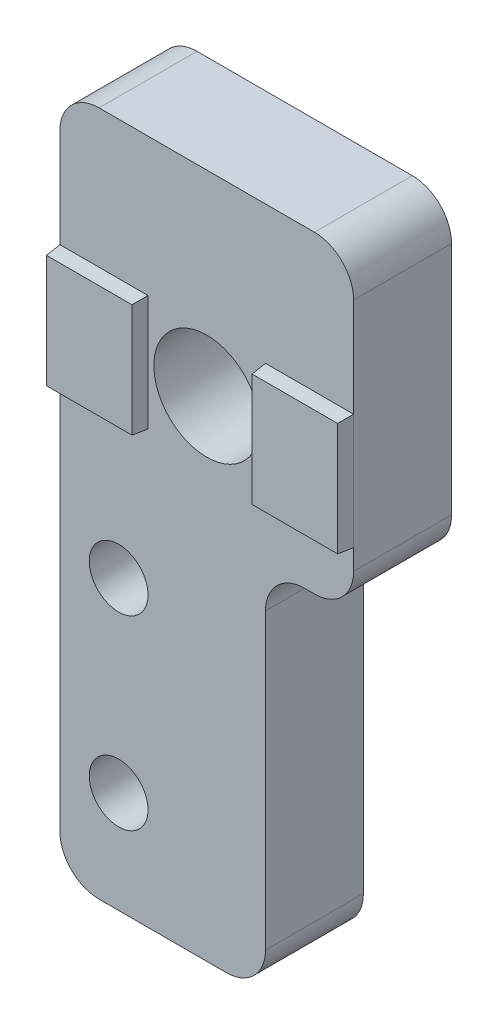
ISO-10303-21;
HEADER;
FILE_DESCRIPTION(('STEP AP214'),'2;1');
FILE_NAME('part.step','',(''),(''),'','','');
FILE_SCHEMA(('AUTOMOTIVE_DESIGN { 1 0 10303 214 1 1 1 1 }'));
ENDSEC;
DATA;
#1=APPLICATION_CONTEXT('core data for automotive mechanical design processes');
#2=APPLICATION_PROTOCOL_DEFINITION('international standard','automotive_design',2000,#1);
#3=PRODUCT_CONTEXT('',#1,'mechanical');
#4=PRODUCT('Part','Part','',(#3));
#5=PRODUCT_RELATED_PRODUCT_CATEGORY('part','',(#4));
#6=PRODUCT_DEFINITION_FORMATION('','',#4);
#7=PRODUCT_DEFINITION_CONTEXT('part definition',#1,'design');
#8=PRODUCT_DEFINITION('design','',#6,#7);
#9=PRODUCT_DEFINITION_SHAPE('','',#8);
#10=(LENGTH_UNIT() NAMED_UNIT(*) SI_UNIT(.MILLI.,.METRE.));
#11=(NAMED_UNIT(*) PLANE_ANGLE_UNIT() SI_UNIT($,.RADIAN.));
#12=(NAMED_UNIT(*) SI_UNIT($,.STERADIAN.) SOLID_ANGLE_UNIT());
#13=UNCERTAINTY_MEASURE_WITH_UNIT(LENGTH_MEASURE(1.E-05),#10,'distance_accuracy_value','');
#14=(GEOMETRIC_REPRESENTATION_CONTEXT(3) GLOBAL_UNCERTAINTY_ASSIGNED_CONTEXT((#13)) GLOBAL_UNIT_ASSIGNED_CONTEXT((#10,
#11,#12)) REPRESENTATION_CONTEXT('',''));
#15=CARTESIAN_POINT('',(0.,0.,0.));
#16=DIRECTION('',(0.,0.,1.));
#17=DIRECTION('',(1.,0.,0.));
#18=AXIS2_PLACEMENT_3D('',#15,#16,#17);
#19=CARTESIAN_POINT('',(8.50000000000001,-33.,5.));
#20=DIRECTION('',(0.,0.,-1.));
#21=DIRECTION('',(-1.,0.,0.));
#22=AXIS2_PLACEMENT_3D('',#19,#20,#21);
#23=PLANE('',#22);
#24=CARTESIAN_POINT('',(2.99999999999999,-29.8,5.));
#25=DIRECTION('',(0.,0.,1.));
#26=DIRECTION('',(1.,0.,0.));
#27=AXIS2_PLACEMENT_3D('',#24,#25,#26);
#28=CIRCLE('',#27,1.5);
#29=CARTESIAN_POINT('',(4.5,-29.8,5.));
#30=VERTEX_POINT('',#29);
#31=EDGE_CURVE('E259',#30,#30,#28,.T.);
#32=ORIENTED_EDGE('',*,*,#31,.F.);
#33=EDGE_LOOP('',(#32));
#34=FACE_BOUND('',#33,.T.);
#35=CARTESIAN_POINT('',(7.50000000000001,-10.,5.));
#36=DIRECTION('',(0.,0.,1.));
#37=DIRECTION('',(1.,0.,0.));
#38=AXIS2_PLACEMENT_3D('',#35,#36,#37);
#39=CIRCLE('',#38,2.7);
#40=CARTESIAN_POINT('',(10.2,-10.,5.));
#41=VERTEX_POINT('',#40);
#42=EDGE_CURVE('E265',#41,#41,#39,.T.);
#43=ORIENTED_EDGE('',*,*,#42,.F.);
#44=EDGE_LOOP('',(#43));
#45=FACE_BOUND('',#44,.T.);
#46=CARTESIAN_POINT('',(3.,-20.3,5.));
#47=DIRECTION('',(0.,0.,1.));
#48=DIRECTION('',(1.,0.,0.));
#49=AXIS2_PLACEMENT_3D('',#46,#47,#48);
#50=CIRCLE('',#49,1.5);
#51=CARTESIAN_POINT('',(4.5,-20.3,5.));
#52=VERTEX_POINT('',#51);
#53=EDGE_CURVE('E251',#52,#52,#50,.T.);
#54=ORIENTED_EDGE('',*,*,#53,.F.);
#55=EDGE_LOOP('',(#54));
#56=FACE_BOUND('',#55,.T.);
#57=DIRECTION('',(-1.,0.,0.));
#58=VECTOR('',#57,1.);
#59=CARTESIAN_POINT('',(15.,-7.05,5.));
#60=LINE('',#59,#58);
#61=CARTESIAN_POINT('',(15.,-7.05,5.));
#62=VERTEX_POINT('',#61);
#63=CARTESIAN_POINT('',(10.5,-7.05,5.));
#64=VERTEX_POINT('',#63);
#65=EDGE_CURVE('E182',#62,#64,#60,.T.);
#66=ORIENTED_EDGE('',*,*,#65,.F.);
#67=DIRECTION('',(0.,1.,0.));
#68=VECTOR('',#67,1.);
#69=CARTESIAN_POINT('',(15.,-2.00000000000001,5.));
#70=LINE('',#69,#68);
#71=CARTESIAN_POINT('',(15.,-2.00000000000001,5.));
#72=VERTEX_POINT('',#71);
#73=EDGE_CURVE('E171',#62,#72,#70,.T.);
#74=ORIENTED_EDGE('',*,*,#73,.T.);
#75=CARTESIAN_POINT('',(13.,-1.99999999999999,5.));
#76=DIRECTION('',(0.,0.,1.));
#77=DIRECTION('',(-1.,0.,0.));
#78=AXIS2_PLACEMENT_3D('',#75,#76,#77);
#79=CIRCLE('',#78,2.);
#80=CARTESIAN_POINT('',(13.,0.,5.));
#81=VERTEX_POINT('',#80);
#82=EDGE_CURVE('E282',#72,#81,#79,.T.);
#83=ORIENTED_EDGE('',*,*,#82,.T.);
#84=DIRECTION('',(-1.,0.,0.));
#85=VECTOR('',#84,1.);
#86=CARTESIAN_POINT('',(2.00000000000001,0.,5.));
#87=LINE('',#86,#85);
#88=CARTESIAN_POINT('',(2.00000000000001,0.,5.));
#89=VERTEX_POINT('',#88);
#90=EDGE_CURVE('E284',#81,#89,#87,.T.);
#91=ORIENTED_EDGE('',*,*,#90,.T.);
#92=CARTESIAN_POINT('',(2.,-2.,5.));
#93=DIRECTION('',(0.,0.,1.));
#94=DIRECTION('',(-1.,0.,0.));
#95=AXIS2_PLACEMENT_3D('',#92,#93,#94);
#96=CIRCLE('',#95,2.);
#97=CARTESIAN_POINT('',(0.,-2.00000000000001,5.));
#98=VERTEX_POINT('',#97);
#99=EDGE_CURVE('E286',#89,#98,#96,.T.);
#100=ORIENTED_EDGE('',*,*,#99,.T.);
#101=DIRECTION('',(0.,-1.,0.));
#102=VECTOR('',#101,1.);
#103=CARTESIAN_POINT('',(0.,-2.00000000000001,5.));
#104=LINE('',#103,#102);
#105=CARTESIAN_POINT('',(0.,-7.05,5.));
#106=VERTEX_POINT('',#105);
#107=EDGE_CURVE('E297',#98,#106,#104,.T.);
#108=ORIENTED_EDGE('',*,*,#107,.T.);
#109=DIRECTION('',(-1.,0.,0.));
#110=VECTOR('',#109,1.);
#111=CARTESIAN_POINT('',(0.,-7.05,5.));
#112=LINE('',#111,#110);
#113=CARTESIAN_POINT('',(4.5,-7.04999999999999,5.));
#114=VERTEX_POINT('',#113);
#115=EDGE_CURVE('E221',#114,#106,#112,.T.);
#116=ORIENTED_EDGE('',*,*,#115,.F.);
#117=DIRECTION('',(0.,1.,0.));
#118=VECTOR('',#117,1.);
#119=CARTESIAN_POINT('',(4.5,-7.04999999999999,5.));
#120=LINE('',#119,#118);
#121=CARTESIAN_POINT('',(4.5,-12.95,5.));
#122=VERTEX_POINT('',#121);
#123=EDGE_CURVE('E218',#122,#114,#120,.T.);
#124=ORIENTED_EDGE('',*,*,#123,.F.);
#125=DIRECTION('',(1.,0.,0.));
#126=VECTOR('',#125,1.);
#127=CARTESIAN_POINT('',(0.,-12.95,5.));
#128=LINE('',#127,#126);
#129=CARTESIAN_POINT('',(0.,-12.95,5.));
#130=VERTEX_POINT('',#129);
#131=EDGE_CURVE('E222',#130,#122,#128,.T.);
#132=ORIENTED_EDGE('',*,*,#131,.F.);
#133=CARTESIAN_POINT('',(0.,-33.,5.));
#134=VERTEX_POINT('',#133);
#135=EDGE_CURVE('E288',#130,#134,#104,.T.);
#136=ORIENTED_EDGE('',*,*,#135,.T.);
#137=CARTESIAN_POINT('',(2.,-33.,5.));
#138=DIRECTION('',(0.,0.,1.));
#139=DIRECTION('',(-1.,0.,0.));
#140=AXIS2_PLACEMENT_3D('',#137,#138,#139);
#141=CIRCLE('',#140,2.);
#142=CARTESIAN_POINT('',(2.00000000000001,-35.,5.));
#143=VERTEX_POINT('',#142);
#144=EDGE_CURVE('E291',#134,#143,#141,.T.);
#145=ORIENTED_EDGE('',*,*,#144,.T.);
#146=DIRECTION('',(1.,0.,0.));
#147=VECTOR('',#146,1.);
#148=CARTESIAN_POINT('',(2.00000000000001,-35.,5.));
#149=LINE('',#148,#147);
#150=CARTESIAN_POINT('',(8.49999999999999,-35.,5.));
#151=VERTEX_POINT('',#150);
#152=EDGE_CURVE('E330',#143,#151,#149,.T.);
#153=ORIENTED_EDGE('',*,*,#152,.T.);
#154=CARTESIAN_POINT('',(8.50000000000001,-33.,5.));
#155=DIRECTION('',(0.,0.,1.));
#156=DIRECTION('',(-1.,0.,0.));
#157=AXIS2_PLACEMENT_3D('',#154,#155,#156);
#158=CIRCLE('',#157,2.);
#159=CARTESIAN_POINT('',(10.5,-33.,5.));
#160=VERTEX_POINT('',#159);
#161=EDGE_CURVE('E271',#151,#160,#158,.T.);
#162=ORIENTED_EDGE('',*,*,#161,.T.);
#163=DIRECTION('',(0.,1.,0.));
#164=VECTOR('',#163,1.);
#165=CARTESIAN_POINT('',(10.5,-33.,5.));
#166=LINE('',#165,#164);
#167=CARTESIAN_POINT('',(10.5,-18.,5.));
#168=VERTEX_POINT('',#167);
#169=EDGE_CURVE('E274',#160,#168,#166,.T.);
#170=ORIENTED_EDGE('',*,*,#169,.T.);
#171=CARTESIAN_POINT('',(12.5,-18.,5.));
#172=DIRECTION('',(0.,0.,-1.));
#173=DIRECTION('',(1.,0.,0.));
#174=AXIS2_PLACEMENT_3D('',#171,#172,#173);
#175=CIRCLE('',#174,2.);
#176=CARTESIAN_POINT('',(12.5,-16.,5.));
#177=VERTEX_POINT('',#176);
#178=EDGE_CURVE('E277',#168,#177,#175,.T.);
#179=ORIENTED_EDGE('',*,*,#178,.T.);
#180=DIRECTION('',(1.,0.,0.));
#181=VECTOR('',#180,1.);
#182=CARTESIAN_POINT('',(13.,-16.,5.));
#183=LINE('',#182,#181);
#184=CARTESIAN_POINT('',(13.,-16.,5.));
#185=VERTEX_POINT('',#184);
#186=EDGE_CURVE('E279',#177,#185,#183,.T.);
#187=ORIENTED_EDGE('',*,*,#186,.T.);
#188=CARTESIAN_POINT('',(13.,-14.,5.));
#189=DIRECTION('',(0.,0.,1.));
#190=DIRECTION('',(-1.,0.,0.));
#191=AXIS2_PLACEMENT_3D('',#188,#189,#190);
#192=CIRCLE('',#191,2.);
#193=CARTESIAN_POINT('',(15.,-14.,5.));
#194=VERTEX_POINT('',#193);
#195=EDGE_CURVE('E180',#185,#194,#192,.T.);
#196=ORIENTED_EDGE('',*,*,#195,.T.);
#197=CARTESIAN_POINT('',(15.,-12.95,5.));
#198=VERTEX_POINT('',#197);
#199=EDGE_CURVE('E179',#194,#198,#70,.T.);
#200=ORIENTED_EDGE('',*,*,#199,.T.);
#201=DIRECTION('',(1.,0.,0.));
#202=VECTOR('',#201,1.);
#203=CARTESIAN_POINT('',(15.,-12.95,5.));
#204=LINE('',#203,#202);
#205=CARTESIAN_POINT('',(10.5,-12.95,5.));
#206=VERTEX_POINT('',#205);
#207=EDGE_CURVE('E55',#206,#198,#204,.T.);
#208=ORIENTED_EDGE('',*,*,#207,.F.);
#209=DIRECTION('',(0.,-1.,0.));
#210=VECTOR('',#209,1.);
#211=CARTESIAN_POINT('',(10.5,-7.05,5.));
#212=LINE('',#211,#210);
#213=EDGE_CURVE('E50',#64,#206,#212,.T.);
#214=ORIENTED_EDGE('',*,*,#213,.F.);
#215=EDGE_LOOP('',(#66,#74,#83,#91,#100,#108,#116,#124,#132,#136,#145,#153,#162,#170,#179,#187,
#196,#200,#208,#214));
#216=FACE_BOUND('',#215,.T.);
#217=ADVANCED_FACE('F33',(#34,#45,#56,#216),#23,.F.);
#218=CARTESIAN_POINT('',(8.50000000000001,-33.,0.));
#219=DIRECTION('',(0.,0.,-1.));
#220=DIRECTION('',(-1.,0.,0.));
#221=AXIS2_PLACEMENT_3D('',#218,#219,#220);
#222=PLANE('',#221);
#223=CARTESIAN_POINT('',(2.99999999999999,-29.8,0.));
#224=DIRECTION('',(0.,0.,1.));
#225=DIRECTION('',(1.,0.,0.));
#226=AXIS2_PLACEMENT_3D('',#223,#224,#225);
#227=CIRCLE('',#226,1.5);
#228=CARTESIAN_POINT('',(4.5,-29.8,0.));
#229=VERTEX_POINT('',#228);
#230=EDGE_CURVE('E254',#229,#229,#227,.T.);
#231=ORIENTED_EDGE('',*,*,#230,.T.);
#232=EDGE_LOOP('',(#231));
#233=FACE_BOUND('',#232,.T.);
#234=CARTESIAN_POINT('',(8.50000000000001,-33.,0.));
#235=DIRECTION('',(0.,0.,1.));
#236=DIRECTION('',(-1.,0.,0.));
#237=AXIS2_PLACEMENT_3D('',#234,#235,#236);
#238=CIRCLE('',#237,2.);
#239=CARTESIAN_POINT('',(8.49999999999999,-35.,0.));
#240=VERTEX_POINT('',#239);
#241=CARTESIAN_POINT('',(10.5,-33.,0.));
#242=VERTEX_POINT('',#241);
#243=EDGE_CURVE('E268',#240,#242,#238,.T.);
#244=ORIENTED_EDGE('',*,*,#243,.F.);
#245=DIRECTION('',(1.,0.,0.));
#246=VECTOR('',#245,1.);
#247=CARTESIAN_POINT('',(2.00000000000001,-35.,0.));
#248=LINE('',#247,#246);
#249=CARTESIAN_POINT('',(2.00000000000001,-35.,0.));
#250=VERTEX_POINT('',#249);
#251=EDGE_CURVE('E275',#250,#240,#248,.T.);
#252=ORIENTED_EDGE('',*,*,#251,.F.);
#253=CARTESIAN_POINT('',(2.,-33.,0.));
#254=DIRECTION('',(0.,0.,1.));
#255=DIRECTION('',(-1.,0.,0.));
#256=AXIS2_PLACEMENT_3D('',#253,#254,#255);
#257=CIRCLE('',#256,2.);
#258=CARTESIAN_POINT('',(0.,-33.,0.));
#259=VERTEX_POINT('',#258);
#260=EDGE_CURVE('E332',#259,#250,#257,.T.);
#261=ORIENTED_EDGE('',*,*,#260,.F.);
#262=DIRECTION('',(0.,-1.,0.));
#263=VECTOR('',#262,1.);
#264=CARTESIAN_POINT('',(0.,-2.00000000000001,0.));
#265=LINE('',#264,#263);
#266=CARTESIAN_POINT('',(0.,-2.00000000000001,0.));
#267=VERTEX_POINT('',#266);
#268=EDGE_CURVE('E334',#267,#259,#265,.T.);
#269=ORIENTED_EDGE('',*,*,#268,.F.);
#270=CARTESIAN_POINT('',(2.,-2.,0.));
#271=DIRECTION('',(0.,0.,1.));
#272=DIRECTION('',(-1.,0.,0.));
#273=AXIS2_PLACEMENT_3D('',#270,#271,#272);
#274=CIRCLE('',#273,2.);
#275=CARTESIAN_POINT('',(2.00000000000001,0.,0.));
#276=VERTEX_POINT('',#275);
#277=EDGE_CURVE('E336',#276,#267,#274,.T.);
#278=ORIENTED_EDGE('',*,*,#277,.F.);
#279=DIRECTION('',(-1.,0.,0.));
#280=VECTOR('',#279,1.);
#281=CARTESIAN_POINT('',(2.00000000000001,0.,0.));
#282=LINE('',#281,#280);
#283=CARTESIAN_POINT('',(13.,0.,0.));
#284=VERTEX_POINT('',#283);
#285=EDGE_CURVE('E338',#284,#276,#282,.T.);
#286=ORIENTED_EDGE('',*,*,#285,.F.);
#287=CARTESIAN_POINT('',(13.,-1.99999999999999,0.));
#288=DIRECTION('',(0.,0.,1.));
#289=DIRECTION('',(-1.,0.,0.));
#290=AXIS2_PLACEMENT_3D('',#287,#288,#289);
#291=CIRCLE('',#290,2.);
#292=CARTESIAN_POINT('',(15.,-2.00000000000001,0.));
#293=VERTEX_POINT('',#292);
#294=EDGE_CURVE('E340',#293,#284,#291,.T.);
#295=ORIENTED_EDGE('',*,*,#294,.F.);
#296=DIRECTION('',(0.,1.,0.));
#297=VECTOR('',#296,1.);
#298=CARTESIAN_POINT('',(15.,-2.00000000000001,0.));
#299=LINE('',#298,#297);
#300=CARTESIAN_POINT('',(15.,-14.,0.));
#301=VERTEX_POINT('',#300);
#302=EDGE_CURVE('E342',#301,#293,#299,.T.);
#303=ORIENTED_EDGE('',*,*,#302,.F.);
#304=CARTESIAN_POINT('',(13.,-14.,0.));
#305=DIRECTION('',(0.,0.,1.));
#306=DIRECTION('',(-1.,0.,0.));
#307=AXIS2_PLACEMENT_3D('',#304,#305,#306);
#308=CIRCLE('',#307,2.);
#309=CARTESIAN_POINT('',(13.,-16.,0.));
#310=VERTEX_POINT('',#309);
#311=EDGE_CURVE('E344',#310,#301,#308,.T.);
#312=ORIENTED_EDGE('',*,*,#311,.F.);
#313=DIRECTION('',(1.,0.,0.));
#314=VECTOR('',#313,1.);
#315=CARTESIAN_POINT('',(13.,-16.,0.));
#316=LINE('',#315,#314);
#317=CARTESIAN_POINT('',(12.5,-16.,0.));
#318=VERTEX_POINT('',#317);
#319=EDGE_CURVE('E346',#318,#310,#316,.T.);
#320=ORIENTED_EDGE('',*,*,#319,.F.);
#321=CARTESIAN_POINT('',(12.5,-18.,0.));
#322=DIRECTION('',(0.,0.,-1.));
#323=DIRECTION('',(1.,0.,0.));
#324=AXIS2_PLACEMENT_3D('',#321,#322,#323);
#325=CIRCLE('',#324,2.);
#326=CARTESIAN_POINT('',(10.5,-18.,0.));
#327=VERTEX_POINT('',#326);
#328=EDGE_CURVE('E348',#327,#318,#325,.T.);
#329=ORIENTED_EDGE('',*,*,#328,.F.);
#330=DIRECTION('',(0.,1.,0.));
#331=VECTOR('',#330,1.);
#332=CARTESIAN_POINT('',(10.5,-33.,0.));
#333=LINE('',#332,#331);
#334=EDGE_CURVE('E350',#242,#327,#333,.T.);
#335=ORIENTED_EDGE('',*,*,#334,.F.);
#336=EDGE_LOOP('',(#244,#252,#261,#269,#278,#286,#295,#303,#312,#320,#329,#335));
#337=FACE_BOUND('',#336,.T.);
#338=CARTESIAN_POINT('',(7.50000000000001,-10.,0.));
#339=DIRECTION('',(0.,0.,1.));
#340=DIRECTION('',(1.,0.,0.));
#341=AXIS2_PLACEMENT_3D('',#338,#339,#340);
#342=CIRCLE('',#341,2.7);
#343=CARTESIAN_POINT('',(10.2,-10.,0.));
#344=VERTEX_POINT('',#343);
#345=EDGE_CURVE('E262',#344,#344,#342,.T.);
#346=ORIENTED_EDGE('',*,*,#345,.T.);
#347=EDGE_LOOP('',(#346));
#348=FACE_BOUND('',#347,.T.);
#349=CARTESIAN_POINT('',(3.,-20.3,0.));
#350=DIRECTION('',(0.,0.,1.));
#351=DIRECTION('',(1.,0.,0.));
#352=AXIS2_PLACEMENT_3D('',#349,#350,#351);
#353=CIRCLE('',#352,1.5);
#354=CARTESIAN_POINT('',(4.5,-20.3,0.));
#355=VERTEX_POINT('',#354);
#356=EDGE_CURVE('E255',#355,#355,#353,.T.);
#357=ORIENTED_EDGE('',*,*,#356,.T.);
#358=EDGE_LOOP('',(#357));
#359=FACE_BOUND('',#358,.T.);
#360=ADVANCED_FACE('F390',(#233,#337,#348,#359),#222,.T.);
#361=CARTESIAN_POINT('',(8.50000000000001,-33.,5.));
#362=DIRECTION('',(0.,0.,-1.));
#363=DIRECTION('',(-1.,0.,0.));
#364=AXIS2_PLACEMENT_3D('',#361,#362,#363);
#365=CYLINDRICAL_SURFACE('',#364,2.);
#366=ORIENTED_EDGE('',*,*,#243,.T.);
#367=DIRECTION('',(0.,0.,-1.));
#368=VECTOR('',#367,1.);
#369=CARTESIAN_POINT('',(10.5,-33.,5.));
#370=LINE('',#369,#368);
#371=EDGE_CURVE('E11',#160,#242,#370,.T.);
#372=ORIENTED_EDGE('',*,*,#371,.F.);
#373=ORIENTED_EDGE('',*,*,#161,.F.);
#374=DIRECTION('',(0.,0.,-1.));
#375=VECTOR('',#374,1.);
#376=CARTESIAN_POINT('',(8.49999999999999,-35.,5.));
#377=LINE('',#376,#375);
#378=EDGE_CURVE('E327',#151,#240,#377,.T.);
#379=ORIENTED_EDGE('',*,*,#378,.T.);
#380=EDGE_LOOP('',(#366,#372,#373,#379));
#381=FACE_BOUND('',#380,.T.);
#382=ADVANCED_FACE('F35',(#381),#365,.T.);
#383=CARTESIAN_POINT('',(10.5,-33.,5.));
#384=DIRECTION('',(-1.,0.,0.));
#385=DIRECTION('',(0.,-1.,0.));
#386=AXIS2_PLACEMENT_3D('',#383,#384,#385);
#387=PLANE('',#386);
#388=ORIENTED_EDGE('',*,*,#334,.T.);
#389=DIRECTION('',(0.,0.,-1.));
#390=VECTOR('',#389,1.);
#391=CARTESIAN_POINT('',(10.5,-18.,5.));
#392=LINE('',#391,#390);
#393=EDGE_CURVE('E42',#168,#327,#392,.T.);
#394=ORIENTED_EDGE('',*,*,#393,.F.);
#395=ORIENTED_EDGE('',*,*,#169,.F.);
#396=ORIENTED_EDGE('',*,*,#371,.T.);
#397=EDGE_LOOP('',(#388,#394,#395,#396));
#398=FACE_BOUND('',#397,.T.);
#399=ADVANCED_FACE('F373',(#398),#387,.F.);
#400=CARTESIAN_POINT('',(12.5,-18.,5.));
#401=DIRECTION('',(0.,0.,-1.));
#402=DIRECTION('',(-1.,0.,0.));
#403=AXIS2_PLACEMENT_3D('',#400,#401,#402);
#404=CYLINDRICAL_SURFACE('',#403,2.);
#405=ORIENTED_EDGE('',*,*,#328,.T.);
#406=DIRECTION('',(0.,0.,-1.));
#407=VECTOR('',#406,1.);
#408=CARTESIAN_POINT('',(12.5,-16.,5.));
#409=LINE('',#408,#407);
#410=EDGE_CURVE('E302',#177,#318,#409,.T.);
#411=ORIENTED_EDGE('',*,*,#410,.F.);
#412=ORIENTED_EDGE('',*,*,#178,.F.);
#413=ORIENTED_EDGE('',*,*,#393,.T.);
#414=EDGE_LOOP('',(#405,#411,#412,#413));
#415=FACE_BOUND('',#414,.T.);
#416=ADVANCED_FACE('F376',(#415),#404,.F.);
#417=CARTESIAN_POINT('',(13.,-16.,5.));
#418=DIRECTION('',(0.,1.,0.));
#419=DIRECTION('',(0.,0.,1.));
#420=AXIS2_PLACEMENT_3D('',#417,#418,#419);
#421=PLANE('',#420);
#422=ORIENTED_EDGE('',*,*,#319,.T.);
#423=DIRECTION('',(0.,0.,-1.));
#424=VECTOR('',#423,1.);
#425=CARTESIAN_POINT('',(13.,-16.,5.));
#426=LINE('',#425,#424);
#427=EDGE_CURVE('E305',#185,#310,#426,.T.);
#428=ORIENTED_EDGE('',*,*,#427,.F.);
#429=ORIENTED_EDGE('',*,*,#186,.F.);
#430=ORIENTED_EDGE('',*,*,#410,.T.);
#431=EDGE_LOOP('',(#422,#428,#429,#430));
#432=FACE_BOUND('',#431,.T.);
#433=ADVANCED_FACE('F381',(#432),#421,.F.);
#434=CARTESIAN_POINT('',(13.,-14.,5.));
#435=DIRECTION('',(0.,0.,-1.));
#436=DIRECTION('',(-1.,0.,0.));
#437=AXIS2_PLACEMENT_3D('',#434,#435,#436);
#438=CYLINDRICAL_SURFACE('',#437,2.);
#439=ORIENTED_EDGE('',*,*,#311,.T.);
#440=DIRECTION('',(0.,0.,-1.));
#441=VECTOR('',#440,1.);
#442=CARTESIAN_POINT('',(15.,-14.,5.));
#443=LINE('',#442,#441);
#444=EDGE_CURVE('E308',#194,#301,#443,.T.);
#445=ORIENTED_EDGE('',*,*,#444,.F.);
#446=ORIENTED_EDGE('',*,*,#195,.F.);
#447=ORIENTED_EDGE('',*,*,#427,.T.);
#448=EDGE_LOOP('',(#439,#445,#446,#447));
#449=FACE_BOUND('',#448,.T.);
#450=ADVANCED_FACE('F385',(#449),#438,.T.);
#451=CARTESIAN_POINT('',(15.,-2.00000000000001,5.));
#452=DIRECTION('',(-1.,0.,0.));
#453=DIRECTION('',(0.,0.,1.));
#454=AXIS2_PLACEMENT_3D('',#451,#452,#453);
#455=PLANE('',#454);
#456=ORIENTED_EDGE('',*,*,#302,.T.);
#457=DIRECTION('',(0.,0.,-1.));
#458=VECTOR('',#457,1.);
#459=CARTESIAN_POINT('',(15.,-2.00000000000001,5.));
#460=LINE('',#459,#458);
#461=EDGE_CURVE('E177',#72,#293,#460,.T.);
#462=ORIENTED_EDGE('',*,*,#461,.F.);
#463=ORIENTED_EDGE('',*,*,#73,.F.);
#464=DIRECTION('',(0.,1.,0.));
#465=VECTOR('',#464,1.);
#466=CARTESIAN_POINT('',(15.,-7.05,5.));
#467=LINE('',#466,#465);
#468=EDGE_CURVE('E175',#198,#62,#467,.T.);
#469=ORIENTED_EDGE('',*,*,#468,.F.);
#470=ORIENTED_EDGE('',*,*,#199,.F.);
#471=ORIENTED_EDGE('',*,*,#444,.T.);
#472=EDGE_LOOP('',(#456,#462,#463,#469,#470,#471));
#473=FACE_BOUND('',#472,.T.);
#474=ADVANCED_FACE('F172',(#473),#455,.F.);
#475=CARTESIAN_POINT('',(13.,-1.99999999999999,5.));
#476=DIRECTION('',(0.,0.,-1.));
#477=DIRECTION('',(-1.,0.,0.));
#478=AXIS2_PLACEMENT_3D('',#475,#476,#477);
#479=CYLINDRICAL_SURFACE('',#478,2.);
#480=ORIENTED_EDGE('',*,*,#294,.T.);
#481=DIRECTION('',(0.,0.,-1.));
#482=VECTOR('',#481,1.);
#483=CARTESIAN_POINT('',(13.,0.,5.));
#484=LINE('',#483,#482);
#485=EDGE_CURVE('E312',#81,#284,#484,.T.);
#486=ORIENTED_EDGE('',*,*,#485,.F.);
#487=ORIENTED_EDGE('',*,*,#82,.F.);
#488=ORIENTED_EDGE('',*,*,#461,.T.);
#489=EDGE_LOOP('',(#480,#486,#487,#488));
#490=FACE_BOUND('',#489,.T.);
#491=ADVANCED_FACE('F396',(#490),#479,.T.);
#492=CARTESIAN_POINT('',(2.00000000000001,0.,5.));
#493=DIRECTION('',(0.,-1.,0.));
#494=DIRECTION('',(1.,0.,0.));
#495=AXIS2_PLACEMENT_3D('',#492,#493,#494);
#496=PLANE('',#495);
#497=ORIENTED_EDGE('',*,*,#285,.T.);
#498=DIRECTION('',(0.,0.,-1.));
#499=VECTOR('',#498,1.);
#500=CARTESIAN_POINT('',(2.00000000000001,0.,5.));
#501=LINE('',#500,#499);
#502=EDGE_CURVE('E315',#89,#276,#501,.T.);
#503=ORIENTED_EDGE('',*,*,#502,.F.);
#504=ORIENTED_EDGE('',*,*,#90,.F.);
#505=ORIENTED_EDGE('',*,*,#485,.T.);
#506=EDGE_LOOP('',(#497,#503,#504,#505));
#507=FACE_BOUND('',#506,.T.);
#508=ADVANCED_FACE('F399',(#507),#496,.F.);
#509=CARTESIAN_POINT('',(2.,-2.,5.));
#510=DIRECTION('',(0.,0.,-1.));
#511=DIRECTION('',(-1.,0.,0.));
#512=AXIS2_PLACEMENT_3D('',#509,#510,#511);
#513=CYLINDRICAL_SURFACE('',#512,2.);
#514=ORIENTED_EDGE('',*,*,#277,.T.);
#515=DIRECTION('',(0.,0.,-1.));
#516=VECTOR('',#515,1.);
#517=CARTESIAN_POINT('',(0.,-2.00000000000001,5.));
#518=LINE('',#517,#516);
#519=EDGE_CURVE('E318',#98,#267,#518,.T.);
#520=ORIENTED_EDGE('',*,*,#519,.F.);
#521=ORIENTED_EDGE('',*,*,#99,.F.);
#522=ORIENTED_EDGE('',*,*,#502,.T.);
#523=EDGE_LOOP('',(#514,#520,#521,#522));
#524=FACE_BOUND('',#523,.T.);
#525=ADVANCED_FACE('F405',(#524),#513,.T.);
#526=CARTESIAN_POINT('',(0.,-2.00000000000001,5.));
#527=DIRECTION('',(1.,0.,0.));
#528=DIRECTION('',(0.,1.,0.));
#529=AXIS2_PLACEMENT_3D('',#526,#527,#528);
#530=PLANE('',#529);
#531=ORIENTED_EDGE('',*,*,#268,.T.);
#532=DIRECTION('',(0.,0.,-1.));
#533=VECTOR('',#532,1.);
#534=CARTESIAN_POINT('',(0.,-33.,5.));
#535=LINE('',#534,#533);
#536=EDGE_CURVE('E321',#134,#259,#535,.T.);
#537=ORIENTED_EDGE('',*,*,#536,.F.);
#538=ORIENTED_EDGE('',*,*,#135,.F.);
#539=DIRECTION('',(0.,-1.,0.));
#540=VECTOR('',#539,1.);
#541=CARTESIAN_POINT('',(0.,-7.05,5.));
#542=LINE('',#541,#540);
#543=EDGE_CURVE('E195',#106,#130,#542,.T.);
#544=ORIENTED_EDGE('',*,*,#543,.F.);
#545=ORIENTED_EDGE('',*,*,#107,.F.);
#546=ORIENTED_EDGE('',*,*,#519,.T.);
#547=EDGE_LOOP('',(#531,#537,#538,#544,#545,#546));
#548=FACE_BOUND('',#547,.T.);
#549=ADVANCED_FACE('F408',(#548),#530,.F.);
#550=CARTESIAN_POINT('',(2.,-33.,5.));
#551=DIRECTION('',(0.,0.,-1.));
#552=DIRECTION('',(-1.,0.,0.));
#553=AXIS2_PLACEMENT_3D('',#550,#551,#552);
#554=CYLINDRICAL_SURFACE('',#553,2.);
#555=ORIENTED_EDGE('',*,*,#260,.T.);
#556=DIRECTION('',(0.,0.,-1.));
#557=VECTOR('',#556,1.);
#558=CARTESIAN_POINT('',(2.00000000000001,-35.,5.));
#559=LINE('',#558,#557);
#560=EDGE_CURVE('E324',#143,#250,#559,.T.);
#561=ORIENTED_EDGE('',*,*,#560,.F.);
#562=ORIENTED_EDGE('',*,*,#144,.F.);
#563=ORIENTED_EDGE('',*,*,#536,.T.);
#564=EDGE_LOOP('',(#555,#561,#562,#563));
#565=FACE_BOUND('',#564,.T.);
#566=ADVANCED_FACE('F360',(#565),#554,.T.);
#567=CARTESIAN_POINT('',(2.00000000000001,-35.,5.));
#568=DIRECTION('',(0.,1.,0.));
#569=DIRECTION('',(0.,0.,1.));
#570=AXIS2_PLACEMENT_3D('',#567,#568,#569);
#571=PLANE('',#570);
#572=ORIENTED_EDGE('',*,*,#251,.T.);
#573=ORIENTED_EDGE('',*,*,#378,.F.);
#574=ORIENTED_EDGE('',*,*,#152,.F.);
#575=ORIENTED_EDGE('',*,*,#560,.T.);
#576=EDGE_LOOP('',(#572,#573,#574,#575));
#577=FACE_BOUND('',#576,.T.);
#578=ADVANCED_FACE('F364',(#577),#571,.F.);
#579=CARTESIAN_POINT('',(7.50000000000001,-10.,5.));
#580=DIRECTION('',(0.,0.,-1.));
#581=DIRECTION('',(-1.,0.,0.));
#582=AXIS2_PLACEMENT_3D('',#579,#580,#581);
#583=CYLINDRICAL_SURFACE('',#582,2.7);
#584=ORIENTED_EDGE('',*,*,#42,.T.);
#585=EDGE_LOOP('',(#584));
#586=FACE_BOUND('',#585,.T.);
#587=ORIENTED_EDGE('',*,*,#345,.F.);
#588=EDGE_LOOP('',(#587));
#589=FACE_BOUND('',#588,.T.);
#590=ADVANCED_FACE('F454',(#586,#589),#583,.F.);
#591=CARTESIAN_POINT('',(2.99999999999999,-29.8,5.));
#592=DIRECTION('',(0.,0.,-1.));
#593=DIRECTION('',(-1.,0.,0.));
#594=AXIS2_PLACEMENT_3D('',#591,#592,#593);
#595=CYLINDRICAL_SURFACE('',#594,1.5);
#596=ORIENTED_EDGE('',*,*,#31,.T.);
#597=EDGE_LOOP('',(#596));
#598=FACE_BOUND('',#597,.T.);
#599=ORIENTED_EDGE('',*,*,#230,.F.);
#600=EDGE_LOOP('',(#599));
#601=FACE_BOUND('',#600,.T.);
#602=ADVANCED_FACE('F438',(#598,#601),#595,.F.);
#603=CARTESIAN_POINT('',(3.,-20.3,5.));
#604=DIRECTION('',(0.,0.,-1.));
#605=DIRECTION('',(-1.,0.,0.));
#606=AXIS2_PLACEMENT_3D('',#603,#604,#605);
#607=CYLINDRICAL_SURFACE('',#606,1.5);
#608=ORIENTED_EDGE('',*,*,#53,.T.);
#609=EDGE_LOOP('',(#608));
#610=FACE_BOUND('',#609,.T.);
#611=ORIENTED_EDGE('',*,*,#356,.F.);
#612=EDGE_LOOP('',(#611));
#613=FACE_BOUND('',#612,.T.);
#614=ADVANCED_FACE('F431',(#610,#613),#607,.F.);
#615=CARTESIAN_POINT('',(0.,-7.05,5.));
#616=DIRECTION('',(-0.996194698091746,0.,0.0871557427476584));
#617=DIRECTION('',(0.0871557427476584,0.,0.996194698091746));
#618=AXIS2_PLACEMENT_3D('',#615,#616,#617);
#619=PLANE('',#618);
#620=ORIENTED_EDGE('',*,*,#543,.T.);
#621=DIRECTION('',(-0.0868265938642478,-0.0868265938642478,-0.992432509138967));
#622=VECTOR('',#621,1.);
#623=CARTESIAN_POINT('',(0.,-12.95,5.));
#624=LINE('',#623,#622);
#625=CARTESIAN_POINT('',(0.065616497644444,-12.8843835023556,5.75));
#626=VERTEX_POINT('',#625);
#627=EDGE_CURVE('E258',#626,#130,#624,.T.);
#628=ORIENTED_EDGE('',*,*,#627,.F.);
#629=DIRECTION('',(0.,1.,0.));
#630=VECTOR('',#629,1.);
#631=CARTESIAN_POINT('',(0.0656164976444431,-7.05,5.75));
#632=LINE('',#631,#630);
#633=CARTESIAN_POINT('',(0.0656164976444431,-7.11561649764444,5.75));
#634=VERTEX_POINT('',#633);
#635=EDGE_CURVE('E230',#634,#626,#632,.F.);
#636=ORIENTED_EDGE('',*,*,#635,.F.);
#637=DIRECTION('',(-0.0868265938642478,0.0868265938642477,-0.992432509138967));
#638=VECTOR('',#637,1.);
#639=CARTESIAN_POINT('',(0.,-7.05,5.));
#640=LINE('',#639,#638);
#641=EDGE_CURVE('E233',#634,#106,#640,.T.);
#642=ORIENTED_EDGE('',*,*,#641,.T.);
#643=EDGE_LOOP('',(#620,#628,#636,#642));
#644=FACE_BOUND('',#643,.T.);
#645=ADVANCED_FACE('F429',(#644),#619,.T.);
#646=CARTESIAN_POINT('',(0.,-12.95,5.));
#647=DIRECTION('',(0.,-0.996194698091746,0.0871557427476584));
#648=DIRECTION('',(0.,-0.0871557427476584,-0.996194698091746));
#649=AXIS2_PLACEMENT_3D('',#646,#647,#648);
#650=PLANE('',#649);
#651=ORIENTED_EDGE('',*,*,#131,.T.);
#652=DIRECTION('',(0.0868265938642478,-0.0868265938642478,-0.992432509138967));
#653=VECTOR('',#652,1.);
#654=CARTESIAN_POINT('',(4.4555207413278,-12.9055207413278,5.50840025301125));
#655=LINE('',#654,#653);
#656=CARTESIAN_POINT('',(4.43438350235556,-12.8843835023556,5.75));
#657=VERTEX_POINT('',#656);
#658=EDGE_CURVE('E241',#657,#122,#655,.T.);
#659=ORIENTED_EDGE('',*,*,#658,.F.);
#660=DIRECTION('',(-1.,0.,0.));
#661=VECTOR('',#660,1.);
#662=CARTESIAN_POINT('',(0.,-12.8843835023556,5.75));
#663=LINE('',#662,#661);
#664=EDGE_CURVE('E247',#626,#657,#663,.F.);
#665=ORIENTED_EDGE('',*,*,#664,.F.);
#666=ORIENTED_EDGE('',*,*,#627,.T.);
#667=EDGE_LOOP('',(#651,#659,#665,#666));
#668=FACE_BOUND('',#667,.T.);
#669=ADVANCED_FACE('F425',(#668),#650,.T.);
#670=CARTESIAN_POINT('',(4.5,-7.04999999999999,5.));
#671=DIRECTION('',(0.996194698091745,0.,0.0871557427476584));
#672=DIRECTION('',(0.0871557427476584,0.,-0.996194698091746));
#673=AXIS2_PLACEMENT_3D('',#670,#671,#672);
#674=PLANE('',#673);
#675=ORIENTED_EDGE('',*,*,#123,.T.);
#676=DIRECTION('',(0.0868265938642478,0.0868265938642479,-0.992432509138967));
#677=VECTOR('',#676,1.);
#678=CARTESIAN_POINT('',(4.4660751416907,-7.0839248583093,5.38776290483909));
#679=LINE('',#678,#677);
#680=CARTESIAN_POINT('',(4.43438350235556,-7.11561649764444,5.75));
#681=VERTEX_POINT('',#680);
#682=EDGE_CURVE('E225',#681,#114,#679,.T.);
#683=ORIENTED_EDGE('',*,*,#682,.F.);
#684=DIRECTION('',(0.,-1.,0.));
#685=VECTOR('',#684,1.);
#686=CARTESIAN_POINT('',(4.43438350235556,-7.04999999999999,5.75));
#687=LINE('',#686,#685);
#688=EDGE_CURVE('E242',#657,#681,#687,.F.);
#689=ORIENTED_EDGE('',*,*,#688,.F.);
#690=ORIENTED_EDGE('',*,*,#658,.T.);
#691=EDGE_LOOP('',(#675,#683,#689,#690));
#692=FACE_BOUND('',#691,.T.);
#693=ADVANCED_FACE('F426',(#692),#674,.T.);
#694=CARTESIAN_POINT('',(0.,-7.05,5.));
#695=DIRECTION('',(0.,0.996194698091746,0.0871557427476584));
#696=DIRECTION('',(0.,-0.0871557427476584,0.996194698091746));
#697=AXIS2_PLACEMENT_3D('',#694,#695,#696);
#698=PLANE('',#697);
#699=ORIENTED_EDGE('',*,*,#115,.T.);
#700=ORIENTED_EDGE('',*,*,#641,.F.);
#701=DIRECTION('',(1.,0.,0.));
#702=VECTOR('',#701,1.);
#703=CARTESIAN_POINT('',(0.,-7.11561649764444,5.75));
#704=LINE('',#703,#702);
#705=EDGE_CURVE('E235',#681,#634,#704,.F.);
#706=ORIENTED_EDGE('',*,*,#705,.F.);
#707=ORIENTED_EDGE('',*,*,#682,.T.);
#708=EDGE_LOOP('',(#699,#700,#706,#707));
#709=FACE_BOUND('',#708,.T.);
#710=ADVANCED_FACE('F428',(#709),#698,.T.);
#711=CARTESIAN_POINT('',(0.,0.,5.75));
#712=DIRECTION('',(0.,0.,1.));
#713=DIRECTION('',(1.,0.,0.));
#714=AXIS2_PLACEMENT_3D('',#711,#712,#713);
#715=PLANE('',#714);
#716=ORIENTED_EDGE('',*,*,#635,.T.);
#717=ORIENTED_EDGE('',*,*,#664,.T.);
#718=ORIENTED_EDGE('',*,*,#688,.T.);
#719=ORIENTED_EDGE('',*,*,#705,.T.);
#720=EDGE_LOOP('',(#716,#717,#718,#719));
#721=FACE_BOUND('',#720,.T.);
#722=ADVANCED_FACE('F423',(#721),#715,.T.);
#723=CARTESIAN_POINT('',(15.,-7.05,5.));
#724=DIRECTION('',(0.996194698091745,0.,0.0871557427476584));
#725=DIRECTION('',(0.0871557427476584,0.,-0.996194698091746));
#726=AXIS2_PLACEMENT_3D('',#723,#724,#725);
#727=PLANE('',#726);
#728=ORIENTED_EDGE('',*,*,#468,.T.);
#729=DIRECTION('',(0.0868265938642478,0.0868265938642478,-0.992432509138967));
#730=VECTOR('',#729,1.);
#731=CARTESIAN_POINT('',(15.,-7.05,5.));
#732=LINE('',#731,#730);
#733=CARTESIAN_POINT('',(14.9343835023556,-7.11561649764444,5.75));
#734=VERTEX_POINT('',#733);
#735=EDGE_CURVE('E189',#734,#62,#732,.T.);
#736=ORIENTED_EDGE('',*,*,#735,.F.);
#737=DIRECTION('',(0.,-1.,0.));
#738=VECTOR('',#737,1.);
#739=CARTESIAN_POINT('',(14.9343835023556,0.,5.75));
#740=LINE('',#739,#738);
#741=CARTESIAN_POINT('',(14.9343835023556,-12.8843835023556,5.75));
#742=VERTEX_POINT('',#741);
#743=EDGE_CURVE('E205',#742,#734,#740,.F.);
#744=ORIENTED_EDGE('',*,*,#743,.F.);
#745=DIRECTION('',(0.0868265938642478,-0.0868265938642478,-0.992432509138967));
#746=VECTOR('',#745,1.);
#747=CARTESIAN_POINT('',(14.9555207413278,-12.9055207413278,5.50840025301124));
#748=LINE('',#747,#746);
#749=EDGE_CURVE('E201',#742,#198,#748,.T.);
#750=ORIENTED_EDGE('',*,*,#749,.T.);
#751=EDGE_LOOP('',(#728,#736,#744,#750));
#752=FACE_BOUND('',#751,.T.);
#753=ADVANCED_FACE('F199',(#752),#727,.T.);
#754=CARTESIAN_POINT('',(15.,-7.05,5.));
#755=DIRECTION('',(0.,0.996194698091746,0.0871557427476584));
#756=DIRECTION('',(0.,-0.0871557427476584,0.996194698091746));
#757=AXIS2_PLACEMENT_3D('',#754,#755,#756);
#758=PLANE('',#757);
#759=ORIENTED_EDGE('',*,*,#65,.T.);
#760=DIRECTION('',(-0.0868265938642478,0.0868265938642478,-0.992432509138967));
#761=VECTOR('',#760,1.);
#762=CARTESIAN_POINT('',(10.5,-7.05,5.));
#763=LINE('',#762,#761);
#764=CARTESIAN_POINT('',(10.5656164976445,-7.11561649764444,5.75));
#765=VERTEX_POINT('',#764);
#766=EDGE_CURVE('E196',#765,#64,#763,.T.);
#767=ORIENTED_EDGE('',*,*,#766,.F.);
#768=DIRECTION('',(1.,0.,0.));
#769=VECTOR('',#768,1.);
#770=CARTESIAN_POINT('',(0.,-7.11561649764444,5.75));
#771=LINE('',#770,#769);
#772=EDGE_CURVE('E191',#734,#765,#771,.F.);
#773=ORIENTED_EDGE('',*,*,#772,.F.);
#774=ORIENTED_EDGE('',*,*,#735,.T.);
#775=EDGE_LOOP('',(#759,#767,#773,#774));
#776=FACE_BOUND('',#775,.T.);
#777=ADVANCED_FACE('F190',(#776),#758,.T.);
#778=CARTESIAN_POINT('',(10.5,-7.05,5.));
#779=DIRECTION('',(-0.996194698091746,0.,0.0871557427476584));
#780=DIRECTION('',(0.0871557427476584,0.,0.996194698091746));
#781=AXIS2_PLACEMENT_3D('',#778,#779,#780);
#782=PLANE('',#781);
#783=ORIENTED_EDGE('',*,*,#213,.T.);
#784=DIRECTION('',(-0.0868265938642478,-0.0868265938642478,-0.992432509138967));
#785=VECTOR('',#784,1.);
#786=CARTESIAN_POINT('',(10.5339248583093,-12.9160751416907,5.38776290483908));
#787=LINE('',#786,#785);
#788=CARTESIAN_POINT('',(10.5656164976445,-12.8843835023556,5.75));
#789=VERTEX_POINT('',#788);
#790=EDGE_CURVE('E208',#789,#206,#787,.T.);
#791=ORIENTED_EDGE('',*,*,#790,.F.);
#792=DIRECTION('',(0.,1.,0.));
#793=VECTOR('',#792,1.);
#794=CARTESIAN_POINT('',(10.5656164976445,0.,5.75));
#795=LINE('',#794,#793);
#796=EDGE_CURVE('E215',#765,#789,#795,.F.);
#797=ORIENTED_EDGE('',*,*,#796,.F.);
#798=ORIENTED_EDGE('',*,*,#766,.T.);
#799=EDGE_LOOP('',(#783,#791,#797,#798));
#800=FACE_BOUND('',#799,.T.);
#801=ADVANCED_FACE('F610',(#800),#782,.T.);
#802=CARTESIAN_POINT('',(15.,-12.95,5.));
#803=DIRECTION('',(0.,-0.996194698091746,0.0871557427476584));
#804=DIRECTION('',(0.,-0.0871557427476584,-0.996194698091746));
#805=AXIS2_PLACEMENT_3D('',#802,#803,#804);
#806=PLANE('',#805);
#807=ORIENTED_EDGE('',*,*,#207,.T.);
#808=ORIENTED_EDGE('',*,*,#749,.F.);
#809=DIRECTION('',(-1.,0.,0.));
#810=VECTOR('',#809,1.);
#811=CARTESIAN_POINT('',(0.,-12.8843835023556,5.75));
#812=LINE('',#811,#810);
#813=EDGE_CURVE('E209',#789,#742,#812,.F.);
#814=ORIENTED_EDGE('',*,*,#813,.F.);
#815=ORIENTED_EDGE('',*,*,#790,.T.);
#816=EDGE_LOOP('',(#807,#808,#814,#815));
#817=FACE_BOUND('',#816,.T.);
#818=ADVANCED_FACE('F618',(#817),#806,.T.);
#819=CARTESIAN_POINT('',(0.,0.,5.75));
#820=DIRECTION('',(0.,0.,-1.));
#821=DIRECTION('',(-1.,0.,0.));
#822=AXIS2_PLACEMENT_3D('',#819,#820,#821);
#823=PLANE('',#822);
#824=ORIENTED_EDGE('',*,*,#743,.T.);
#825=ORIENTED_EDGE('',*,*,#772,.T.);
#826=ORIENTED_EDGE('',*,*,#796,.T.);
#827=ORIENTED_EDGE('',*,*,#813,.T.);
#828=EDGE_LOOP('',(#824,#825,#826,#827));
#829=FACE_BOUND('',#828,.T.);
#830=ADVANCED_FACE('F627',(#829),#823,.F.);
#831=CLOSED_SHELL('',(#217,#360,#382,#399,#416,#433,#450,#474,#491,#508,#525,#549,#566,#578,
#590,#602,#614,#645,#669,#693,#710,#722,#753,#777,#801,#818,#830));
#832=MANIFOLD_SOLID_BREP('B2',#831);
#833=ADVANCED_BREP_SHAPE_REPRESENTATION('',(#18,#832),#14);
#834=SHAPE_DEFINITION_REPRESENTATION(#9,#833);
ENDSEC;
END-ISO-10303-21;
